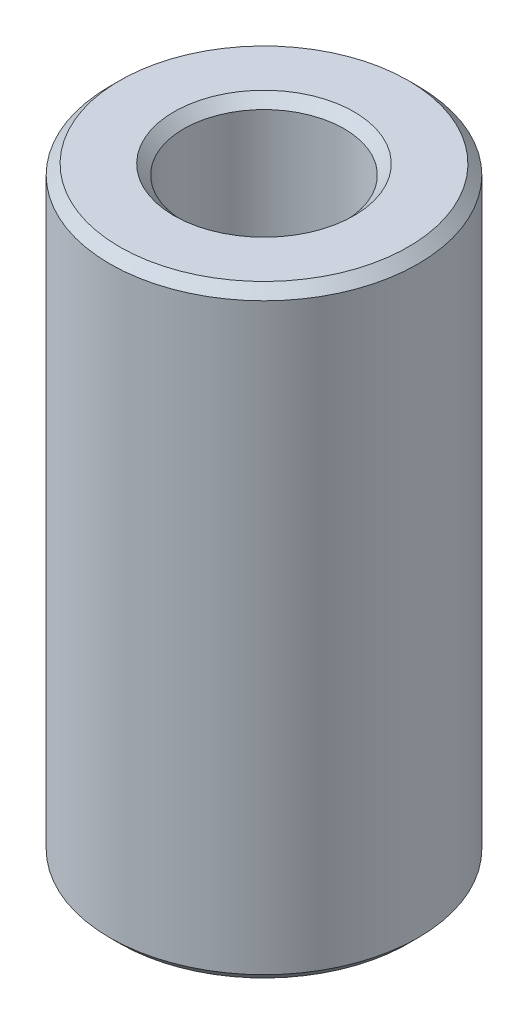
ISO-10303-21;
HEADER;
FILE_DESCRIPTION(('STEP AP214'),'2;1');
FILE_NAME('part.step','',(''),(''),'','','');
FILE_SCHEMA(('AUTOMOTIVE_DESIGN { 1 0 10303 214 1 1 1 1 }'));
ENDSEC;
DATA;
#1=APPLICATION_CONTEXT('core data for automotive mechanical design processes');
#2=APPLICATION_PROTOCOL_DEFINITION('international standard','automotive_design',2000,#1);
#3=PRODUCT_CONTEXT('',#1,'mechanical');
#4=PRODUCT('Part','Part','',(#3));
#5=PRODUCT_RELATED_PRODUCT_CATEGORY('part','',(#4));
#6=PRODUCT_DEFINITION_FORMATION('','',#4);
#7=PRODUCT_DEFINITION_CONTEXT('part definition',#1,'design');
#8=PRODUCT_DEFINITION('design','',#6,#7);
#9=PRODUCT_DEFINITION_SHAPE('','',#8);
#10=(LENGTH_UNIT() NAMED_UNIT(*) SI_UNIT(.MILLI.,.METRE.));
#11=(NAMED_UNIT(*) PLANE_ANGLE_UNIT() SI_UNIT($,.RADIAN.));
#12=(NAMED_UNIT(*) SI_UNIT($,.STERADIAN.) SOLID_ANGLE_UNIT());
#13=UNCERTAINTY_MEASURE_WITH_UNIT(LENGTH_MEASURE(1.E-05),#10,'distance_accuracy_value','');
#14=(GEOMETRIC_REPRESENTATION_CONTEXT(3) GLOBAL_UNCERTAINTY_ASSIGNED_CONTEXT((#13)) GLOBAL_UNIT_ASSIGNED_CONTEXT((#10,
#11,#12)) REPRESENTATION_CONTEXT('',''));
#15=CARTESIAN_POINT('',(0.,0.,0.));
#16=DIRECTION('',(0.,0.,1.));
#17=DIRECTION('',(1.,0.,0.));
#18=AXIS2_PLACEMENT_3D('',#15,#16,#17);
#19=CARTESIAN_POINT('',(0.,19.5807592762553,0.));
#20=DIRECTION('',(0.,-1.,0.));
#21=DIRECTION('',(0.,0.,-1.));
#22=AXIS2_PLACEMENT_3D('',#19,#20,#21);
#23=CYLINDRICAL_SURFACE('',#22,5.);
#24=CARTESIAN_POINT('',(0.,0.318690690900285,0.));
#25=DIRECTION('',(0.,1.,0.));
#26=DIRECTION('',(0.,0.,1.));
#27=AXIS2_PLACEMENT_3D('',#24,#25,#26);
#28=CIRCLE('',#27,5.);
#29=CARTESIAN_POINT('',(0.,0.318690690900285,5.));
#30=VERTEX_POINT('',#29);
#31=EDGE_CURVE('E10',#30,#30,#28,.T.);
#32=ORIENTED_EDGE('',*,*,#31,.T.);
#33=EDGE_LOOP('',(#32));
#34=FACE_BOUND('',#33,.T.);
#35=CARTESIAN_POINT('',(0.,19.262068585355,0.));
#36=DIRECTION('',(0.,1.,0.));
#37=DIRECTION('',(0.,0.,1.));
#38=AXIS2_PLACEMENT_3D('',#35,#36,#37);
#39=CIRCLE('',#38,5.);
#40=CARTESIAN_POINT('',(0.,19.262068585355,5.));
#41=VERTEX_POINT('',#40);
#42=EDGE_CURVE('E50',#41,#41,#39,.F.);
#43=ORIENTED_EDGE('',*,*,#42,.T.);
#44=EDGE_LOOP('',(#43));
#45=FACE_BOUND('',#44,.T.);
#46=ADVANCED_FACE('F39',(#34,#45),#23,.T.);
#47=CARTESIAN_POINT('',(0.,19.5807592762553,0.));
#48=DIRECTION('',(0.,1.,0.));
#49=DIRECTION('',(0.,0.,1.));
#50=AXIS2_PLACEMENT_3D('',#47,#48,#49);
#51=PLANE('',#50);
#52=CARTESIAN_POINT('',(0.,19.5807592762553,0.));
#53=DIRECTION('',(0.,1.,0.));
#54=DIRECTION('',(0.,0.,1.));
#55=AXIS2_PLACEMENT_3D('',#52,#53,#54);
#56=CIRCLE('',#55,2.92270729069881);
#57=CARTESIAN_POINT('',(0.,19.5807592762553,2.92270729069881));
#58=VERTEX_POINT('',#57);
#59=EDGE_CURVE('E58',#58,#58,#56,.F.);
#60=ORIENTED_EDGE('',*,*,#59,.T.);
#61=EDGE_LOOP('',(#60));
#62=FACE_BOUND('',#61,.T.);
#63=CARTESIAN_POINT('',(0.,19.5807592762553,0.));
#64=DIRECTION('',(0.,1.,0.));
#65=DIRECTION('',(0.,0.,1.));
#66=AXIS2_PLACEMENT_3D('',#63,#64,#65);
#67=CIRCLE('',#66,4.68130930909971);
#68=CARTESIAN_POINT('',(0.,19.5807592762553,4.68130930909971));
#69=VERTEX_POINT('',#68);
#70=EDGE_CURVE('E61',#69,#69,#67,.T.);
#71=ORIENTED_EDGE('',*,*,#70,.T.);
#72=EDGE_LOOP('',(#71));
#73=FACE_BOUND('',#72,.T.);
#74=ADVANCED_FACE('F88',(#62,#73),#51,.T.);
#75=CARTESIAN_POINT('',(0.,0.,0.));
#76=DIRECTION('',(0.,1.,0.));
#77=DIRECTION('',(0.,0.,1.));
#78=AXIS2_PLACEMENT_3D('',#75,#76,#77);
#79=PLANE('',#78);
#80=CARTESIAN_POINT('',(0.,0.,0.));
#81=DIRECTION('',(0.,1.,0.));
#82=DIRECTION('',(0.,0.,1.));
#83=AXIS2_PLACEMENT_3D('',#80,#81,#82);
#84=CIRCLE('',#83,2.92270729069881);
#85=CARTESIAN_POINT('',(0.,0.,2.92270729069881));
#86=VERTEX_POINT('',#85);
#87=EDGE_CURVE('E51',#86,#86,#84,.T.);
#88=ORIENTED_EDGE('',*,*,#87,.T.);
#89=EDGE_LOOP('',(#88));
#90=FACE_BOUND('',#89,.T.);
#91=CARTESIAN_POINT('',(0.,0.,0.));
#92=DIRECTION('',(0.,1.,0.));
#93=DIRECTION('',(0.,0.,1.));
#94=AXIS2_PLACEMENT_3D('',#91,#92,#93);
#95=CIRCLE('',#94,4.68130930909971);
#96=CARTESIAN_POINT('',(0.,0.,4.68130930909971));
#97=VERTEX_POINT('',#96);
#98=EDGE_CURVE('E54',#97,#97,#95,.F.);
#99=ORIENTED_EDGE('',*,*,#98,.T.);
#100=EDGE_LOOP('',(#99));
#101=FACE_BOUND('',#100,.T.);
#102=ADVANCED_FACE('F83',(#90,#101),#79,.F.);
#103=CARTESIAN_POINT('',(0.,19.5807592762553,0.));
#104=DIRECTION('',(0.,-1.,0.));
#105=DIRECTION('',(0.,0.,-1.));
#106=AXIS2_PLACEMENT_3D('',#103,#104,#105);
#107=CYLINDRICAL_SURFACE('',#106,2.60401659979852);
#108=CARTESIAN_POINT('',(0.,19.262068585355,0.));
#109=DIRECTION('',(0.,1.,0.));
#110=DIRECTION('',(0.,0.,1.));
#111=AXIS2_PLACEMENT_3D('',#108,#109,#110);
#112=CIRCLE('',#111,2.60401659979852);
#113=CARTESIAN_POINT('',(0.,19.262068585355,2.60401659979852));
#114=VERTEX_POINT('',#113);
#115=EDGE_CURVE('E67',#114,#114,#112,.T.);
#116=ORIENTED_EDGE('',*,*,#115,.T.);
#117=EDGE_LOOP('',(#116));
#118=FACE_BOUND('',#117,.T.);
#119=CARTESIAN_POINT('',(0.,0.318690690900295,0.));
#120=DIRECTION('',(0.,1.,0.));
#121=DIRECTION('',(0.,0.,1.));
#122=AXIS2_PLACEMENT_3D('',#119,#120,#121);
#123=CIRCLE('',#122,2.60401659979852);
#124=CARTESIAN_POINT('',(0.,0.318690690900295,2.60401659979852));
#125=VERTEX_POINT('',#124);
#126=EDGE_CURVE('E69',#125,#125,#123,.F.);
#127=ORIENTED_EDGE('',*,*,#126,.T.);
#128=EDGE_LOOP('',(#127));
#129=FACE_BOUND('',#128,.T.);
#130=ADVANCED_FACE('F71',(#118,#129),#107,.F.);
#131=CARTESIAN_POINT('',(0.,19.262068585355,0.));
#132=DIRECTION('',(0.,1.,0.));
#133=DIRECTION('',(0.,0.,1.));
#134=AXIS2_PLACEMENT_3D('',#131,#132,#133);
#135=CONICAL_SURFACE('',#134,2.60401659979852,0.785398163397447);
#136=ORIENTED_EDGE('',*,*,#59,.F.);
#137=EDGE_LOOP('',(#136));
#138=FACE_BOUND('',#137,.T.);
#139=ORIENTED_EDGE('',*,*,#115,.F.);
#140=EDGE_LOOP('',(#139));
#141=FACE_BOUND('',#140,.T.);
#142=ADVANCED_FACE('F77',(#138,#141),#135,.F.);
#143=CARTESIAN_POINT('',(0.,0.,0.));
#144=DIRECTION('',(0.,-1.,0.));
#145=DIRECTION('',(0.,0.,-1.));
#146=AXIS2_PLACEMENT_3D('',#143,#144,#145);
#147=CONICAL_SURFACE('',#146,2.92270729069881,0.785398163397442);
#148=ORIENTED_EDGE('',*,*,#126,.F.);
#149=EDGE_LOOP('',(#148));
#150=FACE_BOUND('',#149,.T.);
#151=ORIENTED_EDGE('',*,*,#87,.F.);
#152=EDGE_LOOP('',(#151));
#153=FACE_BOUND('',#152,.T.);
#154=ADVANCED_FACE('F73',(#150,#153),#147,.F.);
#155=CARTESIAN_POINT('',(0.,0.318690690900285,0.));
#156=DIRECTION('',(0.,1.,0.));
#157=DIRECTION('',(0.,0.,1.));
#158=AXIS2_PLACEMENT_3D('',#155,#156,#157);
#159=CONICAL_SURFACE('',#158,5.,0.785398163397452);
#160=ORIENTED_EDGE('',*,*,#98,.F.);
#161=EDGE_LOOP('',(#160));
#162=FACE_BOUND('',#161,.T.);
#163=ORIENTED_EDGE('',*,*,#31,.F.);
#164=EDGE_LOOP('',(#163));
#165=FACE_BOUND('',#164,.T.);
#166=ADVANCED_FACE('F76',(#162,#165),#159,.T.);
#167=CARTESIAN_POINT('',(0.,19.5807592762553,0.));
#168=DIRECTION('',(0.,-1.,0.));
#169=DIRECTION('',(0.,0.,-1.));
#170=AXIS2_PLACEMENT_3D('',#167,#168,#169);
#171=CONICAL_SURFACE('',#170,4.68130930909971,0.785398163397447);
#172=ORIENTED_EDGE('',*,*,#42,.F.);
#173=EDGE_LOOP('',(#172));
#174=FACE_BOUND('',#173,.T.);
#175=ORIENTED_EDGE('',*,*,#70,.F.);
#176=EDGE_LOOP('',(#175));
#177=FACE_BOUND('',#176,.T.);
#178=ADVANCED_FACE('F45',(#174,#177),#171,.T.);
#179=CLOSED_SHELL('',(#46,#74,#102,#130,#142,#154,#166,#178));
#180=MANIFOLD_SOLID_BREP('B2',#179);
#181=ADVANCED_BREP_SHAPE_REPRESENTATION('',(#18,#180),#14);
#182=SHAPE_DEFINITION_REPRESENTATION(#9,#181);
ENDSEC;
END-ISO-10303-21;
